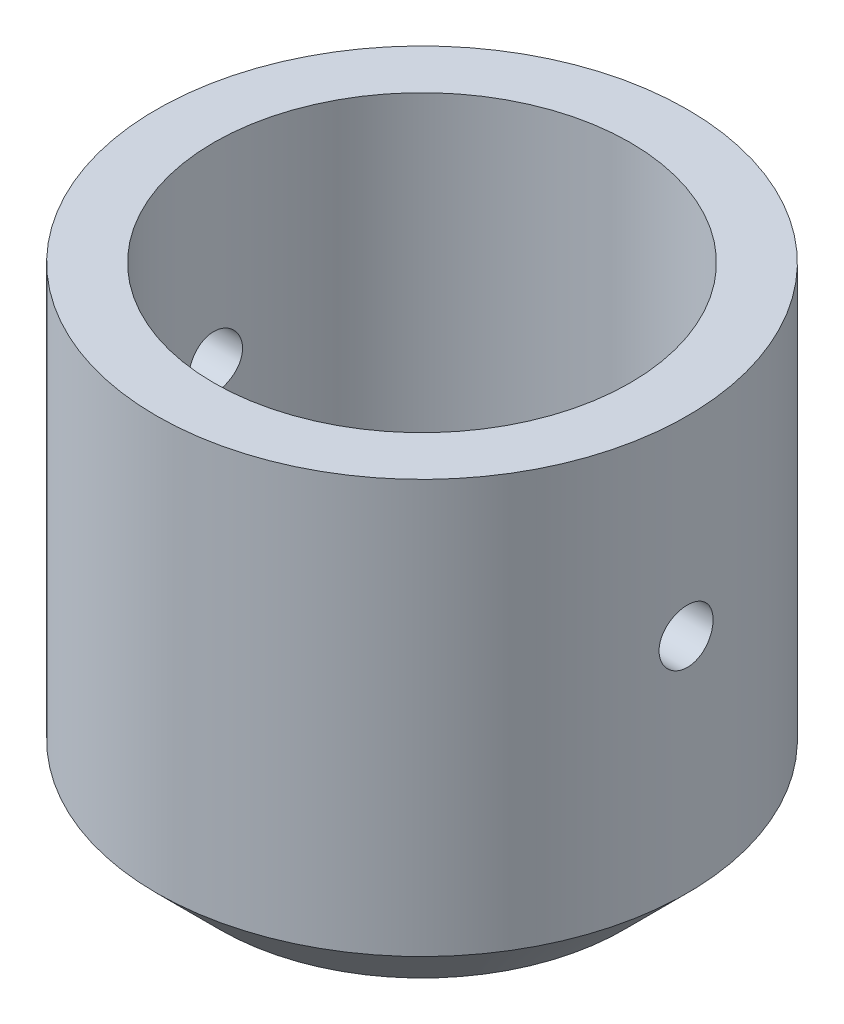
ISO-10303-21;
HEADER;
FILE_DESCRIPTION(('STEP AP214'),'2;1');
FILE_NAME('part.step','',(''),(''),'','','');
FILE_SCHEMA(('AUTOMOTIVE_DESIGN { 1 0 10303 214 1 1 1 1 }'));
ENDSEC;
DATA;
#1=APPLICATION_CONTEXT('core data for automotive mechanical design processes');
#2=APPLICATION_PROTOCOL_DEFINITION('international standard','automotive_design',2000,#1);
#3=PRODUCT_CONTEXT('',#1,'mechanical');
#4=PRODUCT('Part','Part','',(#3));
#5=PRODUCT_RELATED_PRODUCT_CATEGORY('part','',(#4));
#6=PRODUCT_DEFINITION_FORMATION('','',#4);
#7=PRODUCT_DEFINITION_CONTEXT('part definition',#1,'design');
#8=PRODUCT_DEFINITION('design','',#6,#7);
#9=PRODUCT_DEFINITION_SHAPE('','',#8);
#10=(LENGTH_UNIT() NAMED_UNIT(*) SI_UNIT(.MILLI.,.METRE.));
#11=(NAMED_UNIT(*) PLANE_ANGLE_UNIT() SI_UNIT($,.RADIAN.));
#12=(NAMED_UNIT(*) SI_UNIT($,.STERADIAN.) SOLID_ANGLE_UNIT());
#13=UNCERTAINTY_MEASURE_WITH_UNIT(LENGTH_MEASURE(1.E-05),#10,'distance_accuracy_value','');
#14=(GEOMETRIC_REPRESENTATION_CONTEXT(3) GLOBAL_UNCERTAINTY_ASSIGNED_CONTEXT((#13)) GLOBAL_UNIT_ASSIGNED_CONTEXT((#10,
#11,#12)) REPRESENTATION_CONTEXT('',''));
#15=CARTESIAN_POINT('',(0.,0.,0.));
#16=DIRECTION('',(0.,0.,1.));
#17=DIRECTION('',(1.,0.,0.));
#18=AXIS2_PLACEMENT_3D('',#15,#16,#17);
#19=CARTESIAN_POINT('',(0.,15.,0.));
#20=DIRECTION('',(0.,-1.,0.));
#21=DIRECTION('',(0.,0.,-1.));
#22=AXIS2_PLACEMENT_3D('',#19,#20,#21);
#23=CYLINDRICAL_SURFACE('',#22,8.35);
#24=CARTESIAN_POINT('',(0.,2.,0.));
#25=DIRECTION('',(0.,1.,0.));
#26=DIRECTION('',(0.,0.,1.));
#27=AXIS2_PLACEMENT_3D('',#24,#25,#26);
#28=CIRCLE('',#27,8.35);
#29=CARTESIAN_POINT('',(0.,2.,8.35));
#30=VERTEX_POINT('',#29);
#31=EDGE_CURVE('E44',#30,#30,#28,.T.);
#32=ORIENTED_EDGE('',*,*,#31,.T.);
#33=EDGE_LOOP('',(#32));
#34=FACE_BOUND('',#33,.T.);
#35=CARTESIAN_POINT('',(-8.35,8.15,0.));
#36=CARTESIAN_POINT('',(-8.34999944316923,8.15000205954716,-0.0476126946141449));
#37=CARTESIAN_POINT('',(-8.34958843453008,8.15401400326458,-0.0952567571511047));
#38=CARTESIAN_POINT('',(-8.34798836243446,8.16995769010315,-0.189223687277975));
#39=CARTESIAN_POINT('',(-8.3467984446875,8.1818981292319,-0.235545045871959));
#40=CARTESIAN_POINT('',(-8.34377485735061,8.21334732494501,-0.325492251959934));
#41=CARTESIAN_POINT('',(-8.34194157951121,8.23285147664155,-0.369119720831315));
#42=CARTESIAN_POINT('',(-8.3378361936194,8.27886543137993,-0.452472293516209));
#43=CARTESIAN_POINT('',(-8.33556417207477,8.30537385375779,-0.49219816428823));
#44=CARTESIAN_POINT('',(-8.33082629709056,8.36474973717489,-0.566777170888379));
#45=CARTESIAN_POINT('',(-8.32835982692153,8.39763795753025,-0.601613741621025));
#46=CARTESIAN_POINT('',(-8.3235161326924,8.46879555931219,-0.665282871474272));
#47=CARTESIAN_POINT('',(-8.32113891279019,8.50706519104974,-0.694115151156435));
#48=CARTESIAN_POINT('',(-8.31673658750794,8.58800323152671,-0.745016132185192));
#49=CARTESIAN_POINT('',(-8.3147122686347,8.63068113642377,-0.767069807476636));
#50=CARTESIAN_POINT('',(-8.31125262285708,8.71915844463187,-0.803691609685588));
#51=CARTESIAN_POINT('',(-8.30981728090475,8.76495776815791,-0.818259927851267));
#52=CARTESIAN_POINT('',(-8.30770369804674,8.85820868671342,-0.839448281437452));
#53=CARTESIAN_POINT('',(-8.30702283738781,8.90565397079394,-0.846095825914717));
#54=CARTESIAN_POINT('',(-8.30648718020462,9.00099132828545,-0.851338973958966));
#55=CARTESIAN_POINT('',(-8.30663236122938,9.04888338951816,-0.849934796363608));
#56=CARTESIAN_POINT('',(-8.30772999126891,9.1435650584702,-0.839137027505469));
#57=CARTESIAN_POINT('',(-8.30867940358796,9.19035813370739,-0.829773489516254));
#58=CARTESIAN_POINT('',(-8.31127377808599,9.28170516465754,-0.803369566783313));
#59=CARTESIAN_POINT('',(-8.31291874996726,9.32625908912708,-0.786329074954206));
#60=CARTESIAN_POINT('',(-8.31672238727348,9.41195793038025,-0.745021845002124));
#61=CARTESIAN_POINT('',(-8.31888199780303,9.45309638518724,-0.720741790979161));
#62=CARTESIAN_POINT('',(-8.32347078332408,9.53072579879633,-0.665654223985778));
#63=CARTESIAN_POINT('',(-8.32589996649173,9.5672166165632,-0.634846513005359));
#64=CARTESIAN_POINT('',(-8.33076771839972,9.63468954137214,-0.567410378842298));
#65=CARTESIAN_POINT('',(-8.33320627931212,9.66564571753672,-0.530756004145296));
#66=CARTESIAN_POINT('',(-8.33780754688835,9.72096958324273,-0.452757090655396));
#67=CARTESIAN_POINT('',(-8.33997025322562,9.74533726498487,-0.411412546310486));
#68=CARTESIAN_POINT('',(-8.34377688078563,9.78679146081203,-0.325188816456194));
#69=CARTESIAN_POINT('',(-8.34542070683666,9.80387663936005,-0.28030898439748));
#70=CARTESIAN_POINT('',(-8.34800339468075,9.83026173689161,-0.188297211967552));
#71=CARTESIAN_POINT('',(-8.34894227832189,9.83956189715501,-0.141165341441277));
#72=CARTESIAN_POINT('',(-8.35000648517305,9.85008001818181,-0.0462119327346807));
#73=CARTESIAN_POINT('',(-8.35013540984093,9.85133375764766,0.00160560350042084));
#74=CARTESIAN_POINT('',(-8.3495748336842,9.84581744884298,0.0967701166179575));
#75=CARTESIAN_POINT('',(-8.34888534432439,9.83904751297247,0.144117100082784));
#76=CARTESIAN_POINT('',(-8.34676771998065,9.81770571231784,0.236893084095151));
#77=CARTESIAN_POINT('',(-8.34534117312895,9.8031506197861,0.282325982177881));
#78=CARTESIAN_POINT('',(-8.34190945096037,9.76666892099214,0.370105324088997));
#79=CARTESIAN_POINT('',(-8.33990426222631,9.74474214379818,0.41245169632052));
#80=CARTESIAN_POINT('',(-8.33553052812107,9.69405090542053,0.493017568089682));
#81=CARTESIAN_POINT('',(-8.33316074495456,9.66526296059799,0.531222223674341));
#82=CARTESIAN_POINT('',(-8.32832765453166,9.60170021361829,0.602269865043347));
#83=CARTESIAN_POINT('',(-8.32586434484254,9.56692525564956,0.635112711243647));
#84=CARTESIAN_POINT('',(-8.321110978384,9.49221940442419,0.694628850073758));
#85=CARTESIAN_POINT('',(-8.31882160294702,9.45226974221283,0.721278645638567));
#86=CARTESIAN_POINT('',(-8.31468572712449,9.36844098454557,0.767490612166845));
#87=CARTESIAN_POINT('',(-8.31283922049357,9.32456194451408,0.78705288308122));
#88=CARTESIAN_POINT('',(-8.30980242272718,9.2342002700076,0.818495246201723));
#89=CARTESIAN_POINT('',(-8.30861094198637,9.18772252541652,0.830389271692124));
#90=CARTESIAN_POINT('',(-8.3070154185138,9.09341684838795,0.846202703865994));
#91=CARTESIAN_POINT('',(-8.30661135230518,9.0455889562484,0.85012234830672));
#92=CARTESIAN_POINT('',(-8.30663691241569,8.9501742002292,0.849872385837109));
#93=CARTESIAN_POINT('',(-8.30706273464792,8.90258723433435,0.84573968969552));
#94=CARTESIAN_POINT('',(-8.30869197628169,8.80878738516284,0.829579799157224));
#95=CARTESIAN_POINT('',(-8.30989539651535,8.76257450335669,0.817552596312366));
#96=CARTESIAN_POINT('',(-8.31294317536326,8.67283521492378,0.785955374920376));
#97=CARTESIAN_POINT('',(-8.31478743802734,8.62930840727271,0.766386485504712));
#98=CARTESIAN_POINT('',(-8.31890929053727,8.54615120297215,0.720265170284908));
#99=CARTESIAN_POINT('',(-8.32118687847064,8.50652078912703,0.693712775302412));
#100=CARTESIAN_POINT('',(-8.32593126161148,8.43209218485727,0.634239643031875));
#101=CARTESIAN_POINT('',(-8.32839884533738,8.39731602653924,0.601291395446609));
#102=CARTESIAN_POINT('',(-8.33323799769485,8.3337701504075,0.530016568657007));
#103=CARTESIAN_POINT('',(-8.33560954321206,8.30500187171907,0.491688704489298));
#104=CARTESIAN_POINT('',(-8.33999584518169,8.25422920703934,0.410633264325156));
#105=CARTESIAN_POINT('',(-8.34200965867449,8.23224258808984,0.367894516408761));
#106=CARTESIAN_POINT('',(-8.34544340325813,8.19578741096153,0.279338304556912));
#107=CARTESIAN_POINT('',(-8.34686400204243,8.1813103958684,0.233524369713686));
#108=CARTESIAN_POINT('',(-8.34859523248721,8.16388597973548,0.156210384079605));
#109=CARTESIAN_POINT('',(-8.34911955679033,8.15868587566088,0.12520416272725));
#110=CARTESIAN_POINT('',(-8.34982212346143,8.15174221393955,0.0628031764616317));
#111=CARTESIAN_POINT('',(-8.3500003673216,8.14999864138947,0.0314084132242121));
#112=CARTESIAN_POINT('',(-8.35,8.15,0.));
#113=B_SPLINE_CURVE_WITH_KNOTS('',3,(#35,#36,#37,#38,#39,#40,#41,#42,#43,#44,#45,#46,#47,#48,
#49,#50,#51,#52,#53,#54,#55,#56,#57,#58,#59,#60,#61,#62,#63,#64,#65,#66,#67,#68,#69,#70,#71,#72,
#73,#74,#75,#76,#77,#78,#79,#80,#81,#82,#83,#84,#85,#86,#87,#88,#89,#90,#91,#92,#93,#94,#95,#96,
#97,#98,#99,#100,#101,#102,#103,#104,#105,#106,#107,#108,#109,#110,#111,#112),.UNSPECIFIED.,.T.,
.F.,(4,2,2,2,2,2,2,2,2,2,2,2,2,2,2,2,2,2,2,2,2,2,2,2,2,2,2,2,2,2,2,2,2,2,2,2,2,2,4),(0.,
0.142723389958574,0.285603578685411,0.428396916289658,0.571162127806197,0.714399922812412,
0.857644382586305,1.00120411809652,1.14476018552492,1.28781621203637,1.43086835044825,
1.57338273394103,1.71589910542019,1.85867924490409,2.00146371610206,2.14490056477295,
2.28833758323971,2.43180089529072,2.57525976084104,2.71808028678618,2.86089881204706,
3.00341088276143,3.14592625821806,3.28893660742106,3.43195067902072,3.5754988104697,
3.71904491747081,3.86232945903627,4.00560972849102,4.14823476675514,4.2908599576469,
4.43346380317167,4.57606701932612,4.71929777437183,4.86256279960616,5.00620003305593,
5.14967515682896,5.2438251429393,5.3379747231071),.UNSPECIFIED.);
#114=CARTESIAN_POINT('',(-8.35,8.15,0.));
#115=VERTEX_POINT('',#114);
#116=EDGE_CURVE('E94',#115,#115,#113,.T.);
#117=ORIENTED_EDGE('',*,*,#116,.T.);
#118=EDGE_LOOP('',(#117));
#119=FACE_BOUND('',#118,.T.);
#120=CARTESIAN_POINT('',(8.30662386291807,9.,-0.850000000000001));
#121=CARTESIAN_POINT('',(8.30662443059119,8.95238802602972,-0.849997939809027));
#122=CARTESIAN_POINT('',(8.30703762920952,8.90474468188273,-0.845986113433533));
#123=CARTESIAN_POINT('',(8.3086455239255,8.81077924435757,-0.83004293505005));
#124=CARTESIAN_POINT('',(8.30984107836924,8.76445866054007,-0.818102884537386));
#125=CARTESIAN_POINT('',(8.31287689112747,8.67451309278776,-0.786654825630681));
#126=CARTESIAN_POINT('',(8.31471675551777,8.63088648091535,-0.767151440597765));
#127=CARTESIAN_POINT('',(8.31883339766701,8.54753534439641,-0.72113929134427));
#128=CARTESIAN_POINT('',(8.32111008940946,8.50781005385779,-0.694631905907652));
#129=CARTESIAN_POINT('',(8.32585345663725,8.43323039293077,-0.635257070323343));
#130=CARTESIAN_POINT('',(8.32832074251708,8.39839277121699,-0.602368629160063));
#131=CARTESIAN_POINT('',(8.33316175952563,8.33472161270551,-0.531210144364804));
#132=CARTESIAN_POINT('',(8.33553548634635,8.30588835212211,-0.492939853291067));
#133=CARTESIAN_POINT('',(8.339927974225,8.25498634467598,-0.412001234259712));
#134=CARTESIAN_POINT('',(8.3419459521688,8.23293244390603,-0.36932352353288));
#135=CARTESIAN_POINT('',(8.34539292383238,8.19631017128327,-0.280846637324915));
#136=CARTESIAN_POINT('',(8.34682193239033,8.18174161084677,-0.235047540516087));
#137=CARTESIAN_POINT('',(8.34892566949008,8.1605527520281,-0.141797319543794));
#138=CARTESIAN_POINT('',(8.34960301008527,8.15390492305653,-0.0943525109042436));
#139=CARTESIAN_POINT('',(8.35013597905512,8.14866104129299,0.000983915427293126));
#140=CARTESIAN_POINT('',(8.34999162944797,8.15006477274966,0.0488755211124763));
#141=CARTESIAN_POINT('',(8.34889961876463,8.16086183470587,0.143559156093458));
#142=CARTESIAN_POINT('',(8.34795493427192,8.17022556105122,0.190354600366978));
#143=CARTESIAN_POINT('',(8.34537183222297,8.19663068144613,0.281706272119433));
#144=CARTESIAN_POINT('',(8.34373340537603,8.21367217831768,0.326262469601118));
#145=CARTESIAN_POINT('',(8.33994189691614,8.25498149042531,0.411964068402287));
#146=CARTESIAN_POINT('',(8.33778788504249,8.27926238725596,0.453103121395185));
#147=CARTESIAN_POINT('',(8.33320685886369,8.33435175367044,0.530733374049913));
#148=CARTESIAN_POINT('',(8.33077983626058,8.36516042168581,0.567224432367746));
#149=CARTESIAN_POINT('',(8.32591211180274,8.4325972353504,0.634696278238755));
#150=CARTESIAN_POINT('',(8.32347139782464,8.46925113694962,0.665651328089631));
#151=CARTESIAN_POINT('',(8.31886234982593,8.54724870234231,0.720973146628477));
#152=CARTESIAN_POINT('',(8.31669401622428,8.58859237334934,0.745339905182497));
#153=CARTESIAN_POINT('',(8.31287505287328,8.67481586525904,0.786793436638654));
#154=CARTESIAN_POINT('',(8.3112245383773,8.71969647061607,0.803878589143325));
#155=CARTESIAN_POINT('',(8.3086304540878,8.81170992411264,0.830263397683199));
#156=CARTESIAN_POINT('',(8.3076868619587,8.85884270104356,0.839563299698596));
#157=CARTESIAN_POINT('',(8.30661733673237,8.95379653353592,0.850080446520958));
#158=CARTESIAN_POINT('',(8.30648775974851,9.00161356003006,0.851333712136776));
#159=CARTESIAN_POINT('',(8.30705131820683,9.0967769398806,0.845816637575576));
#160=CARTESIAN_POINT('',(8.30774444212201,9.14412329982221,0.839046409817072));
#161=CARTESIAN_POINT('',(8.30987198844687,9.23689617133497,0.817704679785325));
#162=CARTESIAN_POINT('',(8.31130478967448,9.282326647442,0.803150236005961));
#163=CARTESIAN_POINT('',(8.31474893338668,9.37010143236436,0.766670645714851));
#164=CARTESIAN_POINT('',(8.31676028958841,9.41244566797717,0.744745324442513));
#165=CARTESIAN_POINT('',(8.32114372726866,9.4930100799578,0.694056231248787));
#166=CARTESIAN_POINT('',(8.32351705636732,9.5312151793874,0.665268605859438));
#167=CARTESIAN_POINT('',(8.32835295110034,9.60226386503967,0.601706238346353));
#168=CARTESIAN_POINT('',(8.33081551902345,9.63510731363038,0.566931342578234));
#169=CARTESIAN_POINT('',(8.33556343250078,9.6946247598807,0.492225229207041));
#170=CARTESIAN_POINT('',(8.33784808151955,9.72127524805552,0.45227523143852));
#171=CARTESIAN_POINT('',(8.34197257965862,9.76748842971247,0.368445617426375));
#172=CARTESIAN_POINT('',(8.34381243506504,9.78705122336452,0.324566056729934));
#173=CARTESIAN_POINT('',(8.34683690064908,9.81849393093631,0.234204706256247));
#174=CARTESIAN_POINT('',(8.34802271787698,9.83038800465093,0.187727885656066));
#175=CARTESIAN_POINT('',(8.34961045358275,9.84620184634558,0.0934241578083609));
#176=CARTESIAN_POINT('',(8.35001239494693,9.85012184713955,0.0455972900186432));
#177=CARTESIAN_POINT('',(8.34998707300391,9.84987292663433,-0.0498180731496641));
#178=CARTESIAN_POINT('',(8.34956354931133,9.84574048543273,-0.0974066688914952));
#179=CARTESIAN_POINT('',(8.34794226772598,9.829580531536,-0.191209841556272));
#180=CARTESIAN_POINT('',(8.34674450928672,9.81755301326809,-0.237424417509335));
#181=CARTESIAN_POINT('',(8.34370894189392,9.78595451915184,-0.327167110492166));
#182=CARTESIAN_POINT('',(8.3418712273296,9.76638465570332,-0.370695622584349));
#183=CARTESIAN_POINT('',(8.33776051032945,9.72026086455223,-0.45385582948137));
#184=CARTESIAN_POINT('',(8.33548750993266,9.69370696956519,-0.493487542538917));
#185=CARTESIAN_POINT('',(8.33074848987328,9.63423218436729,-0.567916078491491));
#186=CARTESIAN_POINT('',(8.32828167434852,9.60128412713808,-0.602691142427479));
#187=CARTESIAN_POINT('',(8.32343975924117,9.53001013178545,-0.666234899431331));
#188=CARTESIAN_POINT('',(8.32106468178883,9.49168290623485,-0.695002150502004));
#189=CARTESIAN_POINT('',(8.3166684855674,9.41062798953988,-0.745773705609833));
#190=CARTESIAN_POINT('',(8.3146483122907,9.36788901144303,-0.767760058968505));
#191=CARTESIAN_POINT('',(8.31120190491093,9.27933231200366,-0.804214675848216));
#192=CARTESIAN_POINT('',(8.30977500277951,9.23351812128707,-0.818691399851191));
#193=CARTESIAN_POINT('',(8.30803568457839,9.15620491397237,-0.836114998265188));
#194=CARTESIAN_POINT('',(8.30750876364854,9.12519978459273,-0.841314734273352));
#195=CARTESIAN_POINT('',(8.30680266634873,9.06280098581371,-0.848257907055426));
#196=CARTESIAN_POINT('',(8.30662348845156,9.0314073181213,-0.850001359008416));
#197=CARTESIAN_POINT('',(8.30662386291807,9.,-0.850000000000001));
#198=B_SPLINE_CURVE_WITH_KNOTS('',3,(#120,#121,#122,#123,#124,#125,#126,#127,#128,#129,#130,
#131,#132,#133,#134,#135,#136,#137,#138,#139,#140,#141,#142,#143,#144,#145,#146,#147,#148,#149,
#150,#151,#152,#153,#154,#155,#156,#157,#158,#159,#160,#161,#162,#163,#164,#165,#166,#167,#168,
#169,#170,#171,#172,#173,#174,#175,#176,#177,#178,#179,#180,#181,#182,#183,#184,#185,#186,#187,
#188,#189,#190,#191,#192,#193,#194,#195,#196,#197),.UNSPECIFIED.,.T.,.F.,(4,2,2,2,2,2,2,2,2,2,2,
2,2,2,2,2,2,2,2,2,2,2,2,2,2,2,2,2,2,2,2,2,2,2,2,2,2,2,4),(0.,0.142721225291021,
0.285599297446869,0.428390167550818,0.571152949239496,0.714393577021827,0.857640792744834,
1.00119950621321,1.14475460272391,1.28780926638975,1.43086009674951,1.57338122024353,
1.71590425246095,1.85868640094155,2.00147289034448,2.14490687103601,2.28834107235292,
2.43180717586458,2.57526874629773,2.71808765987666,2.86090457241945,3.00340978771481,
3.14591838199081,3.28892975327832,3.43194479504811,3.57549418554106,3.7190415471809,
3.86232309305652,4.00560045557187,4.14823023541924,4.29086011594265,4.43346896842118,
4.57607715288424,4.71930505672906,4.86256729877193,5.00620559836067,5.14968171909234,
5.24382842710765,5.33797472165479),.UNSPECIFIED.);
#199=CARTESIAN_POINT('',(8.30662386291807,9.,-0.850000000000001));
#200=VERTEX_POINT('',#199);
#201=EDGE_CURVE('E68',#200,#200,#198,.T.);
#202=ORIENTED_EDGE('',*,*,#201,.T.);
#203=EDGE_LOOP('',(#202));
#204=FACE_BOUND('',#203,.T.);
#205=CARTESIAN_POINT('',(0.,15.,0.));
#206=DIRECTION('',(0.,1.,0.));
#207=DIRECTION('',(0.,0.,1.));
#208=AXIS2_PLACEMENT_3D('',#205,#206,#207);
#209=CIRCLE('',#208,8.35);
#210=CARTESIAN_POINT('',(0.,15.,8.35));
#211=VERTEX_POINT('',#210);
#212=EDGE_CURVE('E48',#211,#211,#209,.T.);
#213=ORIENTED_EDGE('',*,*,#212,.F.);
#214=EDGE_LOOP('',(#213));
#215=FACE_BOUND('',#214,.T.);
#216=ADVANCED_FACE('F36',(#34,#119,#204,#215),#23,.T.);
#217=CARTESIAN_POINT('',(0.,15.,0.));
#218=DIRECTION('',(0.,1.,0.));
#219=DIRECTION('',(0.,0.,1.));
#220=AXIS2_PLACEMENT_3D('',#217,#218,#219);
#221=PLANE('',#220);
#222=CARTESIAN_POINT('',(0.,15.,0.));
#223=DIRECTION('',(0.,1.,0.));
#224=DIRECTION('',(0.,0.,1.));
#225=AXIS2_PLACEMENT_3D('',#222,#223,#224);
#226=CIRCLE('',#225,6.55);
#227=CARTESIAN_POINT('',(0.,15.,6.55));
#228=VERTEX_POINT('',#227);
#229=EDGE_CURVE('E113',#228,#228,#226,.T.);
#230=ORIENTED_EDGE('',*,*,#229,.F.);
#231=EDGE_LOOP('',(#230));
#232=FACE_BOUND('',#231,.T.);
#233=ORIENTED_EDGE('',*,*,#212,.T.);
#234=EDGE_LOOP('',(#233));
#235=FACE_BOUND('',#234,.T.);
#236=ADVANCED_FACE('F102',(#232,#235),#221,.T.);
#237=CARTESIAN_POINT('',(0.,0.,0.));
#238=DIRECTION('',(0.,1.,0.));
#239=DIRECTION('',(0.,0.,1.));
#240=AXIS2_PLACEMENT_3D('',#237,#238,#239);
#241=PLANE('',#240);
#242=CARTESIAN_POINT('',(0.,0.,0.));
#243=DIRECTION('',(0.,1.,0.));
#244=DIRECTION('',(0.,0.,1.));
#245=AXIS2_PLACEMENT_3D('',#242,#243,#244);
#246=CIRCLE('',#245,6.34999999999999);
#247=CARTESIAN_POINT('',(0.,0.,6.34999999999999));
#248=VERTEX_POINT('',#247);
#249=EDGE_CURVE('E11',#248,#248,#246,.F.);
#250=ORIENTED_EDGE('',*,*,#249,.T.);
#251=EDGE_LOOP('',(#250));
#252=FACE_BOUND('',#251,.T.);
#253=CARTESIAN_POINT('',(0.,0.,0.));
#254=DIRECTION('',(0.,-1.,0.));
#255=DIRECTION('',(0.,0.,-1.));
#256=AXIS2_PLACEMENT_3D('',#253,#254,#255);
#257=CIRCLE('',#256,4.15);
#258=CARTESIAN_POINT('',(0.,0.,-4.15));
#259=VERTEX_POINT('',#258);
#260=EDGE_CURVE('E59',#259,#259,#257,.T.);
#261=ORIENTED_EDGE('',*,*,#260,.F.);
#262=EDGE_LOOP('',(#261));
#263=FACE_BOUND('',#262,.T.);
#264=ADVANCED_FACE('F103',(#252,#263),#241,.F.);
#265=CARTESIAN_POINT('',(0.,-18.5261976670875,0.));
#266=DIRECTION('',(0.,1.,0.));
#267=DIRECTION('',(0.,0.,1.));
#268=AXIS2_PLACEMENT_3D('',#265,#266,#267);
#269=CYLINDRICAL_SURFACE('',#268,6.55);
#270=CARTESIAN_POINT('',(-6.49461315245181,9.,-0.850000000000001));
#271=CARTESIAN_POINT('',(-6.49461385777515,8.95247130035817,-0.849997988596788));
#272=CARTESIAN_POINT('',(-6.49514052304674,8.90491326845368,-0.846000112715371));
#273=CARTESIAN_POINT('',(-6.49718937090902,8.81112183377178,-0.830115618356379));
#274=CARTESIAN_POINT('',(-6.49871258148954,8.76488985034596,-0.818220853628061));
#275=CARTESIAN_POINT('',(-6.50257915255072,8.67512197685368,-0.78690009149471));
#276=CARTESIAN_POINT('',(-6.50492194342383,8.63158423895803,-0.767479323647558));
#277=CARTESIAN_POINT('',(-6.51016301741303,8.54839348294539,-0.721669246281248));
#278=CARTESIAN_POINT('',(-6.51306120883666,8.5087398252265,-0.695281086755018));
#279=CARTESIAN_POINT('',(-6.5191060700373,8.43419629299263,-0.636115177866675));
#280=CARTESIAN_POINT('',(-6.52225399273727,8.39933319528297,-0.603303816417927));
#281=CARTESIAN_POINT('',(-6.52843237368432,8.33559185306761,-0.532295305949774));
#282=CARTESIAN_POINT('',(-6.53146282597575,8.30671391168266,-0.494097884315626));
#283=CARTESIAN_POINT('',(-6.53707769688434,8.25566603331158,-0.413232598543681));
#284=CARTESIAN_POINT('',(-6.53966048445538,8.23352041317634,-0.370549261002497));
#285=CARTESIAN_POINT('',(-6.54407522435919,8.19672161265222,-0.282030161400585));
#286=CARTESIAN_POINT('',(-6.5459072066364,8.18206813344791,-0.236194525148404));
#287=CARTESIAN_POINT('',(-6.54860509392746,8.16074980614331,-0.142946203211472));
#288=CARTESIAN_POINT('',(-6.54947638915393,8.15404036984502,-0.0955438696811831));
#289=CARTESIAN_POINT('',(-6.55017315001213,8.14866235244356,-0.000278628140454438));
#290=CARTESIAN_POINT('',(-6.54999865980245,8.14999343182736,0.0475842603377191));
#291=CARTESIAN_POINT('',(-6.54862786156924,8.16062302476346,0.142108447168932));
#292=CARTESIAN_POINT('',(-6.54743770403147,8.16987358211394,0.188775240136353));
#293=CARTESIAN_POINT('',(-6.54417619088036,8.19600452123019,0.279888420579674));
#294=CARTESIAN_POINT('',(-6.54210481742315,8.21288505749705,0.32433476307295));
#295=CARTESIAN_POINT('',(-6.53730301518935,8.2538474368534,0.409893250108984));
#296=CARTESIAN_POINT('',(-6.53457070066512,8.27794993292608,0.45099539660016));
#297=CARTESIAN_POINT('',(-6.52875250009495,8.33265701741305,0.528589695965808));
#298=CARTESIAN_POINT('',(-6.5256665965815,8.36326192711422,0.565081620905253));
#299=CARTESIAN_POINT('',(-6.51945952970538,8.43037342171404,0.632701518337934));
#300=CARTESIAN_POINT('',(-6.5163382740486,8.46692181519053,0.663788002797166));
#301=CARTESIAN_POINT('',(-6.51043467370283,8.54473946232732,0.719391873300842));
#302=CARTESIAN_POINT('',(-6.50765233023082,8.58600873293855,0.743909235756927));
#303=CARTESIAN_POINT('',(-6.5027416349067,8.67213472688798,0.785681844949255));
#304=CARTESIAN_POINT('',(-6.50061359743901,8.71699316176252,0.802933602136141));
#305=CARTESIAN_POINT('',(-6.49725848007149,8.80900415956026,0.829647624215374));
#306=CARTESIAN_POINT('',(-6.49603135324735,8.85615660286267,0.839110294808585));
#307=CARTESIAN_POINT('',(-6.49462563851062,8.951050234737,0.849922243868238));
#308=CARTESIAN_POINT('',(-6.49443949550079,8.99878465460155,0.851329983943575));
#309=CARTESIAN_POINT('',(-6.4951168297831,9.09380866526518,0.84614651872738));
#310=CARTESIAN_POINT('',(-6.49598028291551,9.14109826627791,0.839555497552244));
#311=CARTESIAN_POINT('',(-6.49865261813522,9.2337140201925,0.818610892983824));
#312=CARTESIAN_POINT('',(-6.50045803405997,9.27904671619863,0.804285762294574));
#313=CARTESIAN_POINT('',(-6.50480805200379,9.36666681673703,0.768308919560913));
#314=CARTESIAN_POINT('',(-6.50735268189626,9.40895410636175,0.74665693123912));
#315=CARTESIAN_POINT('',(-6.51291245776737,9.48954708245479,0.696497837361624));
#316=CARTESIAN_POINT('',(-6.51593019497881,9.52782878107179,0.667952481352846));
#317=CARTESIAN_POINT('',(-6.52208808769628,9.5990788185987,0.604870861385601));
#318=CARTESIAN_POINT('',(-6.52522824833827,9.63204693429247,0.570334345873431));
#319=CARTESIAN_POINT('',(-6.5313004523048,9.69194014081215,0.495995016311244));
#320=CARTESIAN_POINT('',(-6.53423109454983,9.71882675766011,0.456161073909916));
#321=CARTESIAN_POINT('',(-6.53953296625864,9.76552721523447,0.372508512329918));
#322=CARTESIAN_POINT('',(-6.54190420774134,9.78534120792359,0.328689978789737));
#323=CARTESIAN_POINT('',(-6.5458138995153,9.81727079993,0.238438553294402));
#324=CARTESIAN_POINT('',(-6.54735473014744,9.82940842081417,0.192013559635723));
#325=CARTESIAN_POINT('',(-6.54943989476893,9.84571230528624,0.0977631699561019));
#326=CARTESIAN_POINT('',(-6.54998427737006,9.84987895773886,0.0499378423662078));
#327=CARTESIAN_POINT('',(-6.55001493439377,9.85011496903887,-0.0453804154753961));
#328=CARTESIAN_POINT('',(-6.54950895027616,9.84624357025323,-0.092873207399696));
#329=CARTESIAN_POINT('',(-6.54751115114386,9.83063911404719,-0.186526977091632));
#330=CARTESIAN_POINT('',(-6.54601933719823,9.81890606515227,-0.232687956303478));
#331=CARTESIAN_POINT('',(-6.54221673430654,9.78793041215488,-0.322358470076372));
#332=CARTESIAN_POINT('',(-6.53990627974667,9.76869087386797,-0.365869078730143));
#333=CARTESIAN_POINT('',(-6.53472186396499,9.7232545324164,-0.449053558501762));
#334=CARTESIAN_POINT('',(-6.53184789394343,9.6970576206045,-0.488727369690493));
#335=CARTESIAN_POINT('',(-6.52583175567915,9.63823180169131,-0.563414384454828));
#336=CARTESIAN_POINT('',(-6.52268783979745,9.60555885946283,-0.598392766080888));
#337=CARTESIAN_POINT('',(-6.51649998050842,9.53480029962182,-0.662393095313489));
#338=CARTESIAN_POINT('',(-6.51345606090648,9.49671340448147,-0.691413633088599));
#339=CARTESIAN_POINT('',(-6.50779932634738,9.41602526357923,-0.742778881667869));
#340=CARTESIAN_POINT('',(-6.50518835785823,9.37340589359521,-0.765095312815166));
#341=CARTESIAN_POINT('',(-6.50071477307338,9.28501361354896,-0.80222206427621));
#342=CARTESIAN_POINT('',(-6.49885134987292,9.23924416658074,-0.817040482529743));
#343=CARTESIAN_POINT('',(-6.49653244916315,9.16103590496842,-0.835235294984262));
#344=CARTESIAN_POINT('',(-6.49581633767244,9.12908873783831,-0.84076400885909));
#345=CARTESIAN_POINT('',(-6.49485645097839,9.06476558543593,-0.848147031233991));
#346=CARTESIAN_POINT('',(-6.49461267179183,9.03238960378219,-0.850001370720294));
#347=CARTESIAN_POINT('',(-6.49461315245181,9.,-0.850000000000001));
#348=B_SPLINE_CURVE_WITH_KNOTS('',3,(#270,#271,#272,#273,#274,#275,#276,#277,#278,#279,#280,
#281,#282,#283,#284,#285,#286,#287,#288,#289,#290,#291,#292,#293,#294,#295,#296,#297,#298,#299,
#300,#301,#302,#303,#304,#305,#306,#307,#308,#309,#310,#311,#312,#313,#314,#315,#316,#317,#318,
#319,#320,#321,#322,#323,#324,#325,#326,#327,#328,#329,#330,#331,#332,#333,#334,#335,#336,#337,
#338,#339,#340,#341,#342,#343,#344,#345,#346,#347),.UNSPECIFIED.,.T.,.F.,(4,2,2,2,2,2,2,2,2,2,2,
2,2,2,2,2,2,2,2,2,2,2,2,2,2,2,2,2,2,2,2,2,2,2,2,2,2,2,4),(0.,0.142467763676388,
0.285082722689394,0.427598760706465,0.570091290630094,0.713350427628628,0.856616818274494,
1.00039469539464,1.144166837652,1.28712813369755,1.43008339320443,1.57217906464415,
1.71427761353895,1.85678647107063,1.99930237166055,2.14286797634724,2.28643409654143,
2.43006909073781,2.57369660311607,2.71628035085784,2.85886081665294,3.00092028794521,
3.14298511654003,3.28585712984948,3.42873514344762,3.5724932401891,3.71624824795173,
3.85958896571021,4.002922690395,4.14520376206799,4.28748467944639,4.42970754689375,
4.57193263544209,4.7151602140984,4.85842164637491,5.00227917044931,5.14598099334149,
5.24306998097704,5.34015814985158),.UNSPECIFIED.);
#349=CARTESIAN_POINT('',(-6.49461315245181,9.,-0.850000000000001));
#350=VERTEX_POINT('',#349);
#351=EDGE_CURVE('E60',#350,#350,#348,.T.);
#352=ORIENTED_EDGE('',*,*,#351,.T.);
#353=EDGE_LOOP('',(#352));
#354=FACE_BOUND('',#353,.T.);
#355=CARTESIAN_POINT('',(6.49461315245181,9.,-0.850000000000001));
#356=CARTESIAN_POINT('',(6.49461385777516,9.04752869964183,-0.849997988596788));
#357=CARTESIAN_POINT('',(6.49514052304674,9.09508673154633,-0.846000112715371));
#358=CARTESIAN_POINT('',(6.49718937090902,9.18887816622822,-0.830115618356379));
#359=CARTESIAN_POINT('',(6.49871258148954,9.23511014965405,-0.818220853628061));
#360=CARTESIAN_POINT('',(6.50257915255072,9.32487802314632,-0.78690009149471));
#361=CARTESIAN_POINT('',(6.50492194342383,9.36841576104197,-0.767479323647558));
#362=CARTESIAN_POINT('',(6.51016301741303,9.45160651705461,-0.721669246281247));
#363=CARTESIAN_POINT('',(6.51306120883666,9.4912601747735,-0.695281086755018));
#364=CARTESIAN_POINT('',(6.5191060700373,9.56580370700737,-0.636115177866675));
#365=CARTESIAN_POINT('',(6.52225399273727,9.60066680471703,-0.603303816417927));
#366=CARTESIAN_POINT('',(6.52843237368432,9.6644081469324,-0.532295305949774));
#367=CARTESIAN_POINT('',(6.53146282597575,9.69328608831734,-0.494097884315625));
#368=CARTESIAN_POINT('',(6.53707769688434,9.74433396668842,-0.413232598543681));
#369=CARTESIAN_POINT('',(6.53966048445538,9.76647958682366,-0.370549261002497));
#370=CARTESIAN_POINT('',(6.54407522435919,9.80327838734779,-0.282030161400586));
#371=CARTESIAN_POINT('',(6.5459072066364,9.8179318665521,-0.236194525148405));
#372=CARTESIAN_POINT('',(6.54860509392746,9.83925019385669,-0.142946203211472));
#373=CARTESIAN_POINT('',(6.54947638915393,9.84595963015498,-0.0955438696811833));
#374=CARTESIAN_POINT('',(6.55017315001213,9.85133764755645,-0.000278628140454723));
#375=CARTESIAN_POINT('',(6.54999865980245,9.85000656817265,0.0475842603377188));
#376=CARTESIAN_POINT('',(6.54862786156924,9.83937697523655,0.142108447168932));
#377=CARTESIAN_POINT('',(6.54743770403147,9.83012641788606,0.188775240136353));
#378=CARTESIAN_POINT('',(6.54417619088036,9.80399547876982,0.279888420579674));
#379=CARTESIAN_POINT('',(6.54210481742315,9.78711494250295,0.32433476307295));
#380=CARTESIAN_POINT('',(6.53730301518935,9.7461525631466,0.409893250108984));
#381=CARTESIAN_POINT('',(6.53457070066512,9.72205006707392,0.45099539660016));
#382=CARTESIAN_POINT('',(6.52875250009495,9.66734298258695,0.528589695965809));
#383=CARTESIAN_POINT('',(6.5256665965815,9.63673807288579,0.565081620905253));
#384=CARTESIAN_POINT('',(6.51945952970538,9.56962657828596,0.632701518337934));
#385=CARTESIAN_POINT('',(6.5163382740486,9.53307818480947,0.663788002797167));
#386=CARTESIAN_POINT('',(6.51043467370283,9.45526053767268,0.719391873300843));
#387=CARTESIAN_POINT('',(6.50765233023082,9.41399126706145,0.743909235756927));
#388=CARTESIAN_POINT('',(6.5027416349067,9.32786527311202,0.785681844949255));
#389=CARTESIAN_POINT('',(6.50061359743901,9.28300683823748,0.802933602136141));
#390=CARTESIAN_POINT('',(6.49725848007149,9.19099584043974,0.829647624215374));
#391=CARTESIAN_POINT('',(6.49603135324735,9.14384339713734,0.839110294808585));
#392=CARTESIAN_POINT('',(6.49462563851062,9.04894976526301,0.849922243868238));
#393=CARTESIAN_POINT('',(6.49443949550079,9.00121534539845,0.851329983943575));
#394=CARTESIAN_POINT('',(6.4951168297831,8.90619133473482,0.84614651872738));
#395=CARTESIAN_POINT('',(6.49598028291551,8.85890173372209,0.839555497552244));
#396=CARTESIAN_POINT('',(6.49865261813522,8.7662859798075,0.818610892983824));
#397=CARTESIAN_POINT('',(6.50045803405997,8.72095328380137,0.804285762294574));
#398=CARTESIAN_POINT('',(6.50480805200379,8.63333318326297,0.768308919560913));
#399=CARTESIAN_POINT('',(6.50735268189626,8.59104589363825,0.74665693123912));
#400=CARTESIAN_POINT('',(6.51291245776737,8.51045291754521,0.696497837361624));
#401=CARTESIAN_POINT('',(6.51593019497881,8.47217121892822,0.667952481352847));
#402=CARTESIAN_POINT('',(6.52208808769628,8.40092118140131,0.604870861385601));
#403=CARTESIAN_POINT('',(6.52522824833827,8.36795306570753,0.570334345873431));
#404=CARTESIAN_POINT('',(6.5313004523048,8.30805985918786,0.495995016311244));
#405=CARTESIAN_POINT('',(6.53423109454983,8.2811732423399,0.456161073909916));
#406=CARTESIAN_POINT('',(6.53953296625864,8.23447278476553,0.372508512329918));
#407=CARTESIAN_POINT('',(6.54190420774134,8.21465879207641,0.328689978789737));
#408=CARTESIAN_POINT('',(6.5458138995153,8.18272920007,0.238438553294402));
#409=CARTESIAN_POINT('',(6.54735473014744,8.17059157918584,0.192013559635723));
#410=CARTESIAN_POINT('',(6.54943989476893,8.15428769471377,0.0977631699561021));
#411=CARTESIAN_POINT('',(6.54998427737006,8.15012104226114,0.049937842366208));
#412=CARTESIAN_POINT('',(6.55001493439377,8.14988503096113,-0.0453804154753958));
#413=CARTESIAN_POINT('',(6.54950895027616,8.15375642974677,-0.0928732073996957));
#414=CARTESIAN_POINT('',(6.54751115114386,8.16936088595281,-0.186526977091632));
#415=CARTESIAN_POINT('',(6.54601933719823,8.18109393484774,-0.232687956303478));
#416=CARTESIAN_POINT('',(6.54221673430654,8.21206958784512,-0.322358470076372));
#417=CARTESIAN_POINT('',(6.53990627974667,8.23130912613203,-0.365869078730143));
#418=CARTESIAN_POINT('',(6.53472186396499,8.27674546758361,-0.449053558501762));
#419=CARTESIAN_POINT('',(6.53184789394343,8.3029423793955,-0.488727369690493));
#420=CARTESIAN_POINT('',(6.52583175567915,8.36176819830869,-0.563414384454828));
#421=CARTESIAN_POINT('',(6.52268783979745,8.39444114053718,-0.598392766080888));
#422=CARTESIAN_POINT('',(6.51649998050842,8.46519970037818,-0.662393095313489));
#423=CARTESIAN_POINT('',(6.51345606090648,8.50328659551853,-0.691413633088599));
#424=CARTESIAN_POINT('',(6.50779932634738,8.58397473642077,-0.742778881667869));
#425=CARTESIAN_POINT('',(6.50518835785823,8.62659410640479,-0.765095312815165));
#426=CARTESIAN_POINT('',(6.50071477307338,8.71498638645104,-0.80222206427621));
#427=CARTESIAN_POINT('',(6.49885134987292,8.76075583341926,-0.817040482529743));
#428=CARTESIAN_POINT('',(6.49653244916315,8.83896409503159,-0.835235294984262));
#429=CARTESIAN_POINT('',(6.49581633767244,8.87091126216169,-0.84076400885909));
#430=CARTESIAN_POINT('',(6.49485645097839,8.93523441456407,-0.848147031233991));
#431=CARTESIAN_POINT('',(6.49461267179183,8.96761039621781,-0.850001370720294));
#432=CARTESIAN_POINT('',(6.49461315245181,9.,-0.850000000000001));
#433=B_SPLINE_CURVE_WITH_KNOTS('',3,(#355,#356,#357,#358,#359,#360,#361,#362,#363,#364,#365,
#366,#367,#368,#369,#370,#371,#372,#373,#374,#375,#376,#377,#378,#379,#380,#381,#382,#383,#384,
#385,#386,#387,#388,#389,#390,#391,#392,#393,#394,#395,#396,#397,#398,#399,#400,#401,#402,#403,
#404,#405,#406,#407,#408,#409,#410,#411,#412,#413,#414,#415,#416,#417,#418,#419,#420,#421,#422,
#423,#424,#425,#426,#427,#428,#429,#430,#431,#432),.UNSPECIFIED.,.T.,.F.,(4,2,2,2,2,2,2,2,2,2,2,
2,2,2,2,2,2,2,2,2,2,2,2,2,2,2,2,2,2,2,2,2,2,2,2,2,2,2,4),(0.,0.142467763676388,
0.285082722689394,0.427598760706463,0.570091290630094,0.713350427628628,0.856616818274494,
1.00039469539464,1.144166837652,1.28712813369755,1.43008339320443,1.57217906464415,
1.71427761353895,1.85678647107063,1.99930237166055,2.14286797634724,2.28643409654143,
2.43006909073781,2.57369660311607,2.71628035085784,2.85886081665294,3.00092028794521,
3.14298511654003,3.28585712984948,3.42873514344762,3.5724932401891,3.71624824795173,
3.85958896571021,4.002922690395,4.14520376206799,4.28748467944639,4.42970754689375,
4.57193263544209,4.7151602140984,4.85842164637491,5.00227917044931,5.14598099334149,
5.24306998097704,5.34015814985158),.UNSPECIFIED.);
#434=CARTESIAN_POINT('',(6.49461315245181,9.,-0.850000000000001));
#435=VERTEX_POINT('',#434);
#436=EDGE_CURVE('E58',#435,#435,#433,.T.);
#437=ORIENTED_EDGE('',*,*,#436,.T.);
#438=EDGE_LOOP('',(#437));
#439=FACE_BOUND('',#438,.T.);
#440=CARTESIAN_POINT('',(0.,3.,0.));
#441=DIRECTION('',(0.,1.,0.));
#442=DIRECTION('',(0.,0.,1.));
#443=AXIS2_PLACEMENT_3D('',#440,#441,#442);
#444=CIRCLE('',#443,6.55);
#445=CARTESIAN_POINT('',(0.,3.,6.55));
#446=VERTEX_POINT('',#445);
#447=EDGE_CURVE('E52',#446,#446,#444,.F.);
#448=ORIENTED_EDGE('',*,*,#447,.T.);
#449=EDGE_LOOP('',(#448));
#450=FACE_BOUND('',#449,.T.);
#451=ORIENTED_EDGE('',*,*,#229,.T.);
#452=EDGE_LOOP('',(#451));
#453=FACE_BOUND('',#452,.T.);
#454=ADVANCED_FACE('F72',(#354,#439,#450,#453),#269,.F.);
#455=CARTESIAN_POINT('',(0.,3.,0.));
#456=DIRECTION('',(0.,1.,0.));
#457=DIRECTION('',(0.,0.,1.));
#458=AXIS2_PLACEMENT_3D('',#455,#456,#457);
#459=PLANE('',#458);
#460=CARTESIAN_POINT('',(0.,3.,0.));
#461=DIRECTION('',(0.,1.,0.));
#462=DIRECTION('',(0.,0.,1.));
#463=AXIS2_PLACEMENT_3D('',#460,#461,#462);
#464=CIRCLE('',#463,4.15);
#465=CARTESIAN_POINT('',(0.,3.,4.15));
#466=VERTEX_POINT('',#465);
#467=EDGE_CURVE('E55',#466,#466,#464,.T.);
#468=ORIENTED_EDGE('',*,*,#467,.F.);
#469=EDGE_LOOP('',(#468));
#470=FACE_BOUND('',#469,.T.);
#471=ORIENTED_EDGE('',*,*,#447,.F.);
#472=EDGE_LOOP('',(#471));
#473=FACE_BOUND('',#472,.T.);
#474=ADVANCED_FACE('F83',(#470,#473),#459,.T.);
#475=CARTESIAN_POINT('',(-8.35,9.,0.));
#476=DIRECTION('',(1.,0.,0.));
#477=DIRECTION('',(0.,0.,-1.));
#478=AXIS2_PLACEMENT_3D('',#475,#476,#477);
#479=CYLINDRICAL_SURFACE('',#478,0.85);
#480=ORIENTED_EDGE('',*,*,#436,.F.);
#481=EDGE_LOOP('',(#480));
#482=FACE_BOUND('',#481,.T.);
#483=ORIENTED_EDGE('',*,*,#201,.F.);
#484=EDGE_LOOP('',(#483));
#485=FACE_BOUND('',#484,.T.);
#486=ADVANCED_FACE('F81',(#482,#485),#479,.F.);
#487=ORIENTED_EDGE('',*,*,#351,.F.);
#488=EDGE_LOOP('',(#487));
#489=FACE_BOUND('',#488,.T.);
#490=ORIENTED_EDGE('',*,*,#116,.F.);
#491=EDGE_LOOP('',(#490));
#492=FACE_BOUND('',#491,.T.);
#493=ADVANCED_FACE('F76',(#489,#492),#479,.F.);
#494=CARTESIAN_POINT('',(0.,15.,0.));
#495=DIRECTION('',(0.,-1.,0.));
#496=DIRECTION('',(0.,0.,-1.));
#497=AXIS2_PLACEMENT_3D('',#494,#495,#496);
#498=CYLINDRICAL_SURFACE('',#497,4.15);
#499=ORIENTED_EDGE('',*,*,#467,.T.);
#500=EDGE_LOOP('',(#499));
#501=FACE_BOUND('',#500,.T.);
#502=ORIENTED_EDGE('',*,*,#260,.T.);
#503=EDGE_LOOP('',(#502));
#504=FACE_BOUND('',#503,.T.);
#505=ADVANCED_FACE('F80',(#501,#504),#498,.F.);
#506=CARTESIAN_POINT('',(0.,2.,0.));
#507=DIRECTION('',(0.,1.,0.));
#508=DIRECTION('',(0.,0.,1.));
#509=AXIS2_PLACEMENT_3D('',#506,#507,#508);
#510=CONICAL_SURFACE('',#509,8.35,0.78539816339745);
#511=ORIENTED_EDGE('',*,*,#249,.F.);
#512=EDGE_LOOP('',(#511));
#513=FACE_BOUND('',#512,.T.);
#514=ORIENTED_EDGE('',*,*,#31,.F.);
#515=EDGE_LOOP('',(#514));
#516=FACE_BOUND('',#515,.T.);
#517=ADVANCED_FACE('F39',(#513,#516),#510,.T.);
#518=CLOSED_SHELL('',(#216,#236,#264,#454,#474,#486,#493,#505,#517));
#519=MANIFOLD_SOLID_BREP('B2',#518);
#520=ADVANCED_BREP_SHAPE_REPRESENTATION('',(#18,#519),#14);
#521=SHAPE_DEFINITION_REPRESENTATION(#9,#520);
ENDSEC;
END-ISO-10303-21;
